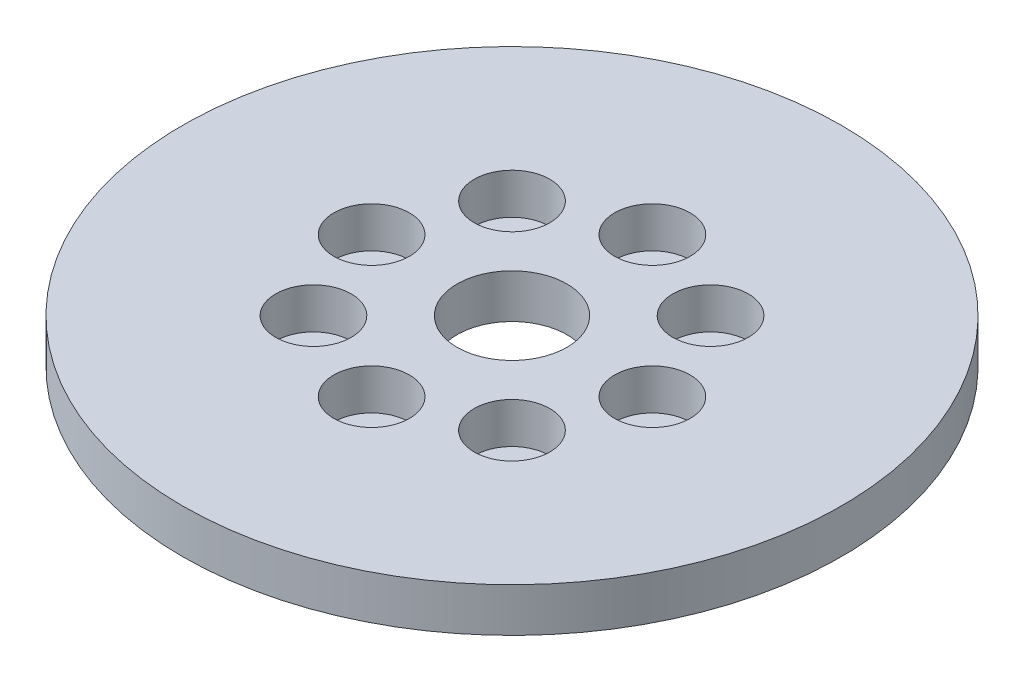
ISO-10303-21;
HEADER;
FILE_DESCRIPTION(('STEP AP214'),'2;1');
FILE_NAME('part.step','',(''),(''),'','','');
FILE_SCHEMA(('AUTOMOTIVE_DESIGN { 1 0 10303 214 1 1 1 1 }'));
ENDSEC;
DATA;
#1=APPLICATION_CONTEXT('core data for automotive mechanical design processes');
#2=APPLICATION_PROTOCOL_DEFINITION('international standard','automotive_design',2000,#1);
#3=PRODUCT_CONTEXT('',#1,'mechanical');
#4=PRODUCT('Part','Part','',(#3));
#5=PRODUCT_RELATED_PRODUCT_CATEGORY('part','',(#4));
#6=PRODUCT_DEFINITION_FORMATION('','',#4);
#7=PRODUCT_DEFINITION_CONTEXT('part definition',#1,'design');
#8=PRODUCT_DEFINITION('design','',#6,#7);
#9=PRODUCT_DEFINITION_SHAPE('','',#8);
#10=(LENGTH_UNIT() NAMED_UNIT(*) SI_UNIT(.MILLI.,.METRE.));
#11=(NAMED_UNIT(*) PLANE_ANGLE_UNIT() SI_UNIT($,.RADIAN.));
#12=(NAMED_UNIT(*) SI_UNIT($,.STERADIAN.) SOLID_ANGLE_UNIT());
#13=UNCERTAINTY_MEASURE_WITH_UNIT(LENGTH_MEASURE(1.E-05),#10,'distance_accuracy_value','');
#14=(GEOMETRIC_REPRESENTATION_CONTEXT(3) GLOBAL_UNCERTAINTY_ASSIGNED_CONTEXT((#13)) GLOBAL_UNIT_ASSIGNED_CONTEXT((#10,
#11,#12)) REPRESENTATION_CONTEXT('',''));
#15=CARTESIAN_POINT('',(0.,0.,0.));
#16=DIRECTION('',(0.,0.,1.));
#17=DIRECTION('',(1.,0.,0.));
#18=AXIS2_PLACEMENT_3D('',#15,#16,#17);
#19=CARTESIAN_POINT('',(0.,6.,0.));
#20=DIRECTION('',(0.,-1.,0.));
#21=DIRECTION('',(0.,0.,-1.));
#22=AXIS2_PLACEMENT_3D('',#19,#20,#21);
#23=CYLINDRICAL_SURFACE('',#22,45.);
#24=CARTESIAN_POINT('',(0.,6.,0.));
#25=DIRECTION('',(0.,1.,0.));
#26=DIRECTION('',(0.,0.,1.));
#27=AXIS2_PLACEMENT_3D('',#24,#25,#26);
#28=CIRCLE('',#27,45.);
#29=CARTESIAN_POINT('',(0.,6.,45.));
#30=VERTEX_POINT('',#29);
#31=EDGE_CURVE('E10',#30,#30,#28,.T.);
#32=ORIENTED_EDGE('',*,*,#31,.F.);
#33=EDGE_LOOP('',(#32));
#34=FACE_BOUND('',#33,.T.);
#35=CARTESIAN_POINT('',(0.,0.,0.));
#36=DIRECTION('',(0.,1.,0.));
#37=DIRECTION('',(0.,0.,1.));
#38=AXIS2_PLACEMENT_3D('',#35,#36,#37);
#39=CIRCLE('',#38,45.);
#40=CARTESIAN_POINT('',(0.,0.,45.));
#41=VERTEX_POINT('',#40);
#42=EDGE_CURVE('E37',#41,#41,#39,.T.);
#43=ORIENTED_EDGE('',*,*,#42,.T.);
#44=EDGE_LOOP('',(#43));
#45=FACE_BOUND('',#44,.T.);
#46=ADVANCED_FACE('F40',(#34,#45),#23,.T.);
#47=CARTESIAN_POINT('',(0.,6.,0.));
#48=DIRECTION('',(0.,1.,0.));
#49=DIRECTION('',(0.,0.,1.));
#50=AXIS2_PLACEMENT_3D('',#47,#48,#49);
#51=PLANE('',#50);
#52=CARTESIAN_POINT('',(0.,6.,19.1701520021483));
#53=DIRECTION('',(0.,1.,0.));
#54=DIRECTION('',(1.,0.,0.));
#55=AXIS2_PLACEMENT_3D('',#52,#53,#54);
#56=CIRCLE('',#55,5.15556280312741);
#57=CARTESIAN_POINT('',(5.15556280312747,6.,19.1701520021483));
#58=VERTEX_POINT('',#57);
#59=EDGE_CURVE('E88',#58,#58,#56,.T.);
#60=ORIENTED_EDGE('',*,*,#59,.F.);
#61=EDGE_LOOP('',(#60));
#62=FACE_BOUND('',#61,.T.);
#63=CARTESIAN_POINT('',(13.555344477096,6.,13.5553444770959));
#64=DIRECTION('',(0.,1.,0.));
#65=DIRECTION('',(0.707106781186544,0.,-0.707106781186551));
#66=AXIS2_PLACEMENT_3D('',#63,#64,#65);
#67=CIRCLE('',#66,5.15556280312741);
#68=CARTESIAN_POINT('',(17.2008778960205,6.,9.90981105817132));
#69=VERTEX_POINT('',#68);
#70=EDGE_CURVE('E79',#69,#69,#67,.T.);
#71=ORIENTED_EDGE('',*,*,#70,.F.);
#72=EDGE_LOOP('',(#71));
#73=FACE_BOUND('',#72,.T.);
#74=CARTESIAN_POINT('',(19.1701520021483,6.,0.));
#75=DIRECTION('',(0.,1.,0.));
#76=DIRECTION('',(0.,0.,-1.));
#77=AXIS2_PLACEMENT_3D('',#74,#75,#76);
#78=CIRCLE('',#77,5.15556280312741);
#79=CARTESIAN_POINT('',(19.1701520021483,6.,-5.15556280312741));
#80=VERTEX_POINT('',#79);
#81=EDGE_CURVE('E74',#80,#80,#78,.T.);
#82=ORIENTED_EDGE('',*,*,#81,.F.);
#83=EDGE_LOOP('',(#82));
#84=FACE_BOUND('',#83,.T.);
#85=CARTESIAN_POINT('',(13.5553444770958,6.,-13.555344477096));
#86=DIRECTION('',(0.,1.,0.));
#87=DIRECTION('',(-0.707106781186554,0.,-0.707106781186541));
#88=AXIS2_PLACEMENT_3D('',#85,#86,#87);
#89=CIRCLE('',#88,5.15556280312741);
#90=CARTESIAN_POINT('',(9.90981105817126,6.,-17.2008778960205));
#91=VERTEX_POINT('',#90);
#92=EDGE_CURVE('E70',#91,#91,#89,.T.);
#93=ORIENTED_EDGE('',*,*,#92,.F.);
#94=EDGE_LOOP('',(#93));
#95=FACE_BOUND('',#94,.T.);
#96=CARTESIAN_POINT('',(-2.00796683934861E-13,6.,-19.1701520021483));
#97=DIRECTION('',(0.,1.,0.));
#98=DIRECTION('',(-1.,0.,0.));
#99=AXIS2_PLACEMENT_3D('',#96,#97,#98);
#100=CIRCLE('',#99,5.15556280312741);
#101=CARTESIAN_POINT('',(-5.15556280312761,6.,-19.1701520021482));
#102=VERTEX_POINT('',#101);
#103=EDGE_CURVE('E100',#102,#102,#100,.T.);
#104=ORIENTED_EDGE('',*,*,#103,.F.);
#105=EDGE_LOOP('',(#104));
#106=FACE_BOUND('',#105,.T.);
#107=CARTESIAN_POINT('',(-13.5553444770961,6.,-13.5553444770958));
#108=DIRECTION('',(0.,1.,0.));
#109=DIRECTION('',(-0.707106781186539,0.,0.707106781186556));
#110=AXIS2_PLACEMENT_3D('',#107,#108,#109);
#111=CIRCLE('',#110,5.15556280312741);
#112=CARTESIAN_POINT('',(-17.2008778960206,6.,-9.9098110581712));
#113=VERTEX_POINT('',#112);
#114=EDGE_CURVE('E93',#113,#113,#111,.T.);
#115=ORIENTED_EDGE('',*,*,#114,.F.);
#116=EDGE_LOOP('',(#115));
#117=FACE_BOUND('',#116,.T.);
#118=CARTESIAN_POINT('',(-13.5553444770959,6.,13.555344477096));
#119=DIRECTION('',(0.,1.,0.));
#120=DIRECTION('',(0.707106781186549,0.,0.707106781186546));
#121=AXIS2_PLACEMENT_3D('',#118,#119,#120);
#122=CIRCLE('',#121,5.15556280312741);
#123=CARTESIAN_POINT('',(-9.90981105817138,6.,17.2008778960205));
#124=VERTEX_POINT('',#123);
#125=EDGE_CURVE('E61',#124,#124,#122,.T.);
#126=ORIENTED_EDGE('',*,*,#125,.F.);
#127=EDGE_LOOP('',(#126));
#128=FACE_BOUND('',#127,.T.);
#129=CARTESIAN_POINT('',(-19.1701520021483,6.,0.));
#130=DIRECTION('',(0.,1.,0.));
#131=DIRECTION('',(0.,0.,1.));
#132=AXIS2_PLACEMENT_3D('',#129,#130,#131);
#133=CIRCLE('',#132,5.15556280312741);
#134=CARTESIAN_POINT('',(-19.1701520021483,6.,5.15556280312741));
#135=VERTEX_POINT('',#134);
#136=EDGE_CURVE('E54',#135,#135,#133,.T.);
#137=ORIENTED_EDGE('',*,*,#136,.F.);
#138=EDGE_LOOP('',(#137));
#139=FACE_BOUND('',#138,.T.);
#140=CARTESIAN_POINT('',(0.,6.,0.));
#141=DIRECTION('',(0.,1.,0.));
#142=DIRECTION('',(0.,0.,1.));
#143=AXIS2_PLACEMENT_3D('',#140,#141,#142);
#144=CIRCLE('',#143,7.5);
#145=CARTESIAN_POINT('',(0.,6.,7.5));
#146=VERTEX_POINT('',#145);
#147=EDGE_CURVE('E50',#146,#146,#144,.T.);
#148=ORIENTED_EDGE('',*,*,#147,.F.);
#149=EDGE_LOOP('',(#148));
#150=FACE_BOUND('',#149,.T.);
#151=ORIENTED_EDGE('',*,*,#31,.T.);
#152=EDGE_LOOP('',(#151));
#153=FACE_BOUND('',#152,.T.);
#154=ADVANCED_FACE('F115',(#62,#73,#84,#95,#106,#117,#128,#139,#150,#153),#51,.T.);
#155=CARTESIAN_POINT('',(0.,0.,0.));
#156=DIRECTION('',(0.,1.,0.));
#157=DIRECTION('',(0.,0.,1.));
#158=AXIS2_PLACEMENT_3D('',#155,#156,#157);
#159=PLANE('',#158);
#160=CARTESIAN_POINT('',(0.,0.,0.));
#161=DIRECTION('',(0.,1.,0.));
#162=DIRECTION('',(0.,0.,1.));
#163=AXIS2_PLACEMENT_3D('',#160,#161,#162);
#164=CIRCLE('',#163,7.5);
#165=CARTESIAN_POINT('',(0.,0.,7.5));
#166=VERTEX_POINT('',#165);
#167=EDGE_CURVE('E47',#166,#166,#164,.T.);
#168=ORIENTED_EDGE('',*,*,#167,.T.);
#169=EDGE_LOOP('',(#168));
#170=FACE_BOUND('',#169,.T.);
#171=ORIENTED_EDGE('',*,*,#42,.F.);
#172=EDGE_LOOP('',(#171));
#173=FACE_BOUND('',#172,.T.);
#174=ADVANCED_FACE('F113',(#170,#173),#159,.F.);
#175=CARTESIAN_POINT('',(0.,6.,0.));
#176=DIRECTION('',(0.,-1.,0.));
#177=DIRECTION('',(0.,0.,-1.));
#178=AXIS2_PLACEMENT_3D('',#175,#176,#177);
#179=CYLINDRICAL_SURFACE('',#178,7.5);
#180=ORIENTED_EDGE('',*,*,#147,.T.);
#181=EDGE_LOOP('',(#180));
#182=FACE_BOUND('',#181,.T.);
#183=ORIENTED_EDGE('',*,*,#167,.F.);
#184=EDGE_LOOP('',(#183));
#185=FACE_BOUND('',#184,.T.);
#186=ADVANCED_FACE('F127',(#182,#185),#179,.F.);
#187=CARTESIAN_POINT('',(-19.1701520021483,0.430173273722734,0.));
#188=DIRECTION('',(0.,1.,0.));
#189=DIRECTION('',(0.,0.,1.));
#190=AXIS2_PLACEMENT_3D('',#187,#188,#189);
#191=CYLINDRICAL_SURFACE('',#190,5.15556280312741);
#192=CARTESIAN_POINT('',(-19.1701520021483,0.430173273722734,0.));
#193=DIRECTION('',(0.,1.,0.));
#194=DIRECTION('',(0.,0.,1.));
#195=AXIS2_PLACEMENT_3D('',#192,#193,#194);
#196=CIRCLE('',#195,5.15556280312741);
#197=CARTESIAN_POINT('',(-19.1701520021483,0.430173273722734,5.15556280312741));
#198=VERTEX_POINT('',#197);
#199=EDGE_CURVE('E55',#198,#198,#196,.T.);
#200=ORIENTED_EDGE('',*,*,#199,.F.);
#201=EDGE_LOOP('',(#200));
#202=FACE_BOUND('',#201,.T.);
#203=ORIENTED_EDGE('',*,*,#136,.T.);
#204=EDGE_LOOP('',(#203));
#205=FACE_BOUND('',#204,.T.);
#206=ADVANCED_FACE('F129',(#202,#205),#191,.F.);
#207=CARTESIAN_POINT('',(-19.1701520021483,0.430173273722734,0.));
#208=DIRECTION('',(0.,1.,0.));
#209=DIRECTION('',(0.,0.,1.));
#210=AXIS2_PLACEMENT_3D('',#207,#208,#209);
#211=PLANE('',#210);
#212=ORIENTED_EDGE('',*,*,#199,.T.);
#213=EDGE_LOOP('',(#212));
#214=FACE_BOUND('',#213,.T.);
#215=ADVANCED_FACE('F157',(#214),#211,.T.);
#216=CARTESIAN_POINT('',(-13.5553444770959,0.430173273722734,13.555344477096));
#217=DIRECTION('',(0.,1.,0.));
#218=DIRECTION('',(0.,0.,1.));
#219=AXIS2_PLACEMENT_3D('',#216,#217,#218);
#220=CYLINDRICAL_SURFACE('',#219,5.15556280312741);
#221=CARTESIAN_POINT('',(-13.5553444770959,0.430173273722734,13.555344477096));
#222=DIRECTION('',(0.,1.,0.));
#223=DIRECTION('',(0.707106781186549,0.,0.707106781186546));
#224=AXIS2_PLACEMENT_3D('',#221,#222,#223);
#225=CIRCLE('',#224,5.15556280312741);
#226=CARTESIAN_POINT('',(-9.90981105817138,0.430173273722734,17.2008778960205));
#227=VERTEX_POINT('',#226);
#228=EDGE_CURVE('E59',#227,#227,#225,.T.);
#229=ORIENTED_EDGE('',*,*,#228,.F.);
#230=EDGE_LOOP('',(#229));
#231=FACE_BOUND('',#230,.T.);
#232=ORIENTED_EDGE('',*,*,#125,.T.);
#233=EDGE_LOOP('',(#232));
#234=FACE_BOUND('',#233,.T.);
#235=ADVANCED_FACE('F170',(#231,#234),#220,.F.);
#236=CARTESIAN_POINT('',(-13.5553444770959,0.430173273722734,13.555344477096));
#237=DIRECTION('',(0.,1.,0.));
#238=DIRECTION('',(0.707106781186549,0.,0.707106781186546));
#239=AXIS2_PLACEMENT_3D('',#236,#237,#238);
#240=PLANE('',#239);
#241=ORIENTED_EDGE('',*,*,#228,.T.);
#242=EDGE_LOOP('',(#241));
#243=FACE_BOUND('',#242,.T.);
#244=ADVANCED_FACE('F182',(#243),#240,.T.);
#245=CARTESIAN_POINT('',(-13.5553444770961,0.430173273722734,-13.5553444770958));
#246=DIRECTION('',(0.,1.,0.));
#247=DIRECTION('',(0.,0.,1.));
#248=AXIS2_PLACEMENT_3D('',#245,#246,#247);
#249=CYLINDRICAL_SURFACE('',#248,5.15556280312741);
#250=CARTESIAN_POINT('',(-13.5553444770961,0.430173273722734,-13.5553444770958));
#251=DIRECTION('',(0.,1.,0.));
#252=DIRECTION('',(-0.707106781186539,0.,0.707106781186556));
#253=AXIS2_PLACEMENT_3D('',#250,#251,#252);
#254=CIRCLE('',#253,5.15556280312741);
#255=CARTESIAN_POINT('',(-17.2008778960206,0.430173273722734,-9.9098110581712));
#256=VERTEX_POINT('',#255);
#257=EDGE_CURVE('E94',#256,#256,#254,.T.);
#258=ORIENTED_EDGE('',*,*,#257,.F.);
#259=EDGE_LOOP('',(#258));
#260=FACE_BOUND('',#259,.T.);
#261=ORIENTED_EDGE('',*,*,#114,.T.);
#262=EDGE_LOOP('',(#261));
#263=FACE_BOUND('',#262,.T.);
#264=ADVANCED_FACE('F189',(#260,#263),#249,.F.);
#265=CARTESIAN_POINT('',(-13.5553444770961,0.430173273722734,-13.5553444770958));
#266=DIRECTION('',(0.,1.,0.));
#267=DIRECTION('',(-0.707106781186539,0.,0.707106781186556));
#268=AXIS2_PLACEMENT_3D('',#265,#266,#267);
#269=PLANE('',#268);
#270=ORIENTED_EDGE('',*,*,#257,.T.);
#271=EDGE_LOOP('',(#270));
#272=FACE_BOUND('',#271,.T.);
#273=ADVANCED_FACE('F107',(#272),#269,.T.);
#274=CARTESIAN_POINT('',(-2.00796683934861E-13,0.430173273722734,-19.1701520021483));
#275=DIRECTION('',(0.,1.,0.));
#276=DIRECTION('',(0.,0.,1.));
#277=AXIS2_PLACEMENT_3D('',#274,#275,#276);
#278=CYLINDRICAL_SURFACE('',#277,5.15556280312741);
#279=CARTESIAN_POINT('',(-2.00796683934861E-13,0.430173273722734,-19.1701520021483));
#280=DIRECTION('',(0.,1.,0.));
#281=DIRECTION('',(-1.,0.,0.));
#282=AXIS2_PLACEMENT_3D('',#279,#280,#281);
#283=CIRCLE('',#282,5.15556280312741);
#284=CARTESIAN_POINT('',(-5.15556280312761,0.430173273722734,-19.1701520021482));
#285=VERTEX_POINT('',#284);
#286=EDGE_CURVE('E72',#285,#285,#283,.T.);
#287=ORIENTED_EDGE('',*,*,#286,.F.);
#288=EDGE_LOOP('',(#287));
#289=FACE_BOUND('',#288,.T.);
#290=ORIENTED_EDGE('',*,*,#103,.T.);
#291=EDGE_LOOP('',(#290));
#292=FACE_BOUND('',#291,.T.);
#293=ADVANCED_FACE('F104',(#289,#292),#278,.F.);
#294=CARTESIAN_POINT('',(-2.00796683934861E-13,0.430173273722734,-19.1701520021483));
#295=DIRECTION('',(0.,1.,0.));
#296=DIRECTION('',(-1.,0.,0.));
#297=AXIS2_PLACEMENT_3D('',#294,#295,#296);
#298=PLANE('',#297);
#299=ORIENTED_EDGE('',*,*,#286,.T.);
#300=EDGE_LOOP('',(#299));
#301=FACE_BOUND('',#300,.T.);
#302=ADVANCED_FACE('F103',(#301),#298,.T.);
#303=CARTESIAN_POINT('',(13.5553444770958,0.430173273722734,-13.555344477096));
#304=DIRECTION('',(0.,1.,0.));
#305=DIRECTION('',(0.,0.,1.));
#306=AXIS2_PLACEMENT_3D('',#303,#304,#305);
#307=CYLINDRICAL_SURFACE('',#306,5.15556280312741);
#308=CARTESIAN_POINT('',(13.5553444770958,0.430173273722734,-13.555344477096));
#309=DIRECTION('',(0.,1.,0.));
#310=DIRECTION('',(-0.707106781186554,0.,-0.707106781186541));
#311=AXIS2_PLACEMENT_3D('',#308,#309,#310);
#312=CIRCLE('',#311,5.15556280312741);
#313=CARTESIAN_POINT('',(9.90981105817126,0.430173273722734,-17.2008778960205));
#314=VERTEX_POINT('',#313);
#315=EDGE_CURVE('E69',#314,#314,#312,.T.);
#316=ORIENTED_EDGE('',*,*,#315,.F.);
#317=EDGE_LOOP('',(#316));
#318=FACE_BOUND('',#317,.T.);
#319=ORIENTED_EDGE('',*,*,#92,.T.);
#320=EDGE_LOOP('',(#319));
#321=FACE_BOUND('',#320,.T.);
#322=ADVANCED_FACE('F219',(#318,#321),#307,.F.);
#323=CARTESIAN_POINT('',(13.5553444770958,0.430173273722734,-13.555344477096));
#324=DIRECTION('',(0.,1.,0.));
#325=DIRECTION('',(-0.707106781186554,0.,-0.707106781186541));
#326=AXIS2_PLACEMENT_3D('',#323,#324,#325);
#327=PLANE('',#326);
#328=ORIENTED_EDGE('',*,*,#315,.T.);
#329=EDGE_LOOP('',(#328));
#330=FACE_BOUND('',#329,.T.);
#331=ADVANCED_FACE('F227',(#330),#327,.T.);
#332=CARTESIAN_POINT('',(19.1701520021483,0.430173273722734,0.));
#333=DIRECTION('',(0.,1.,0.));
#334=DIRECTION('',(0.,0.,1.));
#335=AXIS2_PLACEMENT_3D('',#332,#333,#334);
#336=CYLINDRICAL_SURFACE('',#335,5.15556280312741);
#337=CARTESIAN_POINT('',(19.1701520021483,0.430173273722734,0.));
#338=DIRECTION('',(0.,1.,0.));
#339=DIRECTION('',(0.,0.,-1.));
#340=AXIS2_PLACEMENT_3D('',#337,#338,#339);
#341=CIRCLE('',#340,5.15556280312741);
#342=CARTESIAN_POINT('',(19.1701520021483,0.430173273722734,-5.15556280312741));
#343=VERTEX_POINT('',#342);
#344=EDGE_CURVE('E80',#343,#343,#341,.T.);
#345=ORIENTED_EDGE('',*,*,#344,.F.);
#346=EDGE_LOOP('',(#345));
#347=FACE_BOUND('',#346,.T.);
#348=ORIENTED_EDGE('',*,*,#81,.T.);
#349=EDGE_LOOP('',(#348));
#350=FACE_BOUND('',#349,.T.);
#351=ADVANCED_FACE('F240',(#347,#350),#336,.F.);
#352=CARTESIAN_POINT('',(19.1701520021483,0.430173273722734,0.));
#353=DIRECTION('',(0.,1.,0.));
#354=DIRECTION('',(0.,0.,-1.));
#355=AXIS2_PLACEMENT_3D('',#352,#353,#354);
#356=PLANE('',#355);
#357=ORIENTED_EDGE('',*,*,#344,.T.);
#358=EDGE_LOOP('',(#357));
#359=FACE_BOUND('',#358,.T.);
#360=ADVANCED_FACE('F246',(#359),#356,.T.);
#361=CARTESIAN_POINT('',(13.555344477096,0.430173273722734,13.5553444770959));
#362=DIRECTION('',(0.,1.,0.));
#363=DIRECTION('',(0.,0.,1.));
#364=AXIS2_PLACEMENT_3D('',#361,#362,#363);
#365=CYLINDRICAL_SURFACE('',#364,5.15556280312741);
#366=CARTESIAN_POINT('',(13.555344477096,0.430173273722734,13.5553444770959));
#367=DIRECTION('',(0.,1.,0.));
#368=DIRECTION('',(0.707106781186544,0.,-0.707106781186551));
#369=AXIS2_PLACEMENT_3D('',#366,#367,#368);
#370=CIRCLE('',#369,5.15556280312741);
#371=CARTESIAN_POINT('',(17.2008778960205,0.430173273722734,9.90981105817132));
#372=VERTEX_POINT('',#371);
#373=EDGE_CURVE('E82',#372,#372,#370,.T.);
#374=ORIENTED_EDGE('',*,*,#373,.F.);
#375=EDGE_LOOP('',(#374));
#376=FACE_BOUND('',#375,.T.);
#377=ORIENTED_EDGE('',*,*,#70,.T.);
#378=EDGE_LOOP('',(#377));
#379=FACE_BOUND('',#378,.T.);
#380=ADVANCED_FACE('F254',(#376,#379),#365,.F.);
#381=CARTESIAN_POINT('',(13.555344477096,0.430173273722734,13.5553444770959));
#382=DIRECTION('',(0.,1.,0.));
#383=DIRECTION('',(0.707106781186544,0.,-0.707106781186551));
#384=AXIS2_PLACEMENT_3D('',#381,#382,#383);
#385=PLANE('',#384);
#386=ORIENTED_EDGE('',*,*,#373,.T.);
#387=EDGE_LOOP('',(#386));
#388=FACE_BOUND('',#387,.T.);
#389=ADVANCED_FACE('F262',(#388),#385,.T.);
#390=CARTESIAN_POINT('',(0.,0.430173273722734,19.1701520021483));
#391=DIRECTION('',(0.,1.,0.));
#392=DIRECTION('',(0.,0.,1.));
#393=AXIS2_PLACEMENT_3D('',#390,#391,#392);
#394=CYLINDRICAL_SURFACE('',#393,5.15556280312741);
#395=CARTESIAN_POINT('',(0.,0.430173273722734,19.1701520021483));
#396=DIRECTION('',(0.,1.,0.));
#397=DIRECTION('',(1.,0.,0.));
#398=AXIS2_PLACEMENT_3D('',#395,#396,#397);
#399=CIRCLE('',#398,5.15556280312741);
#400=CARTESIAN_POINT('',(5.15556280312747,0.430173273722734,19.1701520021483));
#401=VERTEX_POINT('',#400);
#402=EDGE_CURVE('E63',#401,#401,#399,.T.);
#403=ORIENTED_EDGE('',*,*,#402,.F.);
#404=EDGE_LOOP('',(#403));
#405=FACE_BOUND('',#404,.T.);
#406=ORIENTED_EDGE('',*,*,#59,.T.);
#407=EDGE_LOOP('',(#406));
#408=FACE_BOUND('',#407,.T.);
#409=ADVANCED_FACE('F272',(#405,#408),#394,.F.);
#410=CARTESIAN_POINT('',(0.,0.430173273722734,19.1701520021483));
#411=DIRECTION('',(0.,1.,0.));
#412=DIRECTION('',(1.,0.,0.));
#413=AXIS2_PLACEMENT_3D('',#410,#411,#412);
#414=PLANE('',#413);
#415=ORIENTED_EDGE('',*,*,#402,.T.);
#416=EDGE_LOOP('',(#415));
#417=FACE_BOUND('',#416,.T.);
#418=ADVANCED_FACE('F285',(#417),#414,.T.);
#419=CLOSED_SHELL('',(#46,#154,#174,#186,#206,#215,#235,#244,#264,#273,#293,#302,#322,#331,#351,
#360,#380,#389,#409,#418));
#420=MANIFOLD_SOLID_BREP('B2',#419);
#421=ADVANCED_BREP_SHAPE_REPRESENTATION('',(#18,#420),#14);
#422=SHAPE_DEFINITION_REPRESENTATION(#9,#421);
ENDSEC;
END-ISO-10303-21;
